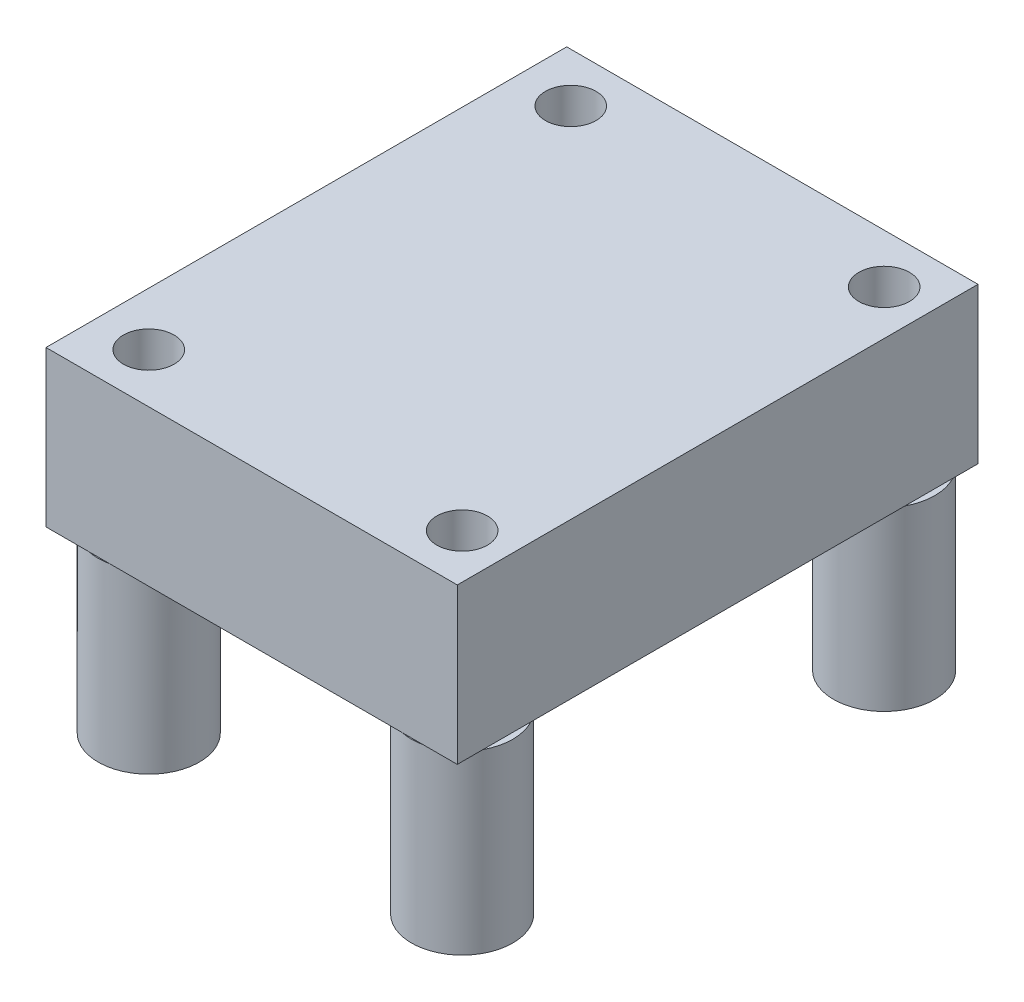
ISO-10303-21;
HEADER;
FILE_DESCRIPTION(('STEP AP214'),'2;1');
FILE_NAME('part.step','',(''),(''),'','','');
FILE_SCHEMA(('AUTOMOTIVE_DESIGN { 1 0 10303 214 1 1 1 1 }'));
ENDSEC;
DATA;
#1=APPLICATION_CONTEXT('core data for automotive mechanical design processes');
#2=APPLICATION_PROTOCOL_DEFINITION('international standard','automotive_design',2000,#1);
#3=PRODUCT_CONTEXT('',#1,'mechanical');
#4=PRODUCT('Part','Part','',(#3));
#5=PRODUCT_RELATED_PRODUCT_CATEGORY('part','',(#4));
#6=PRODUCT_DEFINITION_FORMATION('','',#4);
#7=PRODUCT_DEFINITION_CONTEXT('part definition',#1,'design');
#8=PRODUCT_DEFINITION('design','',#6,#7);
#9=PRODUCT_DEFINITION_SHAPE('','',#8);
#10=(LENGTH_UNIT() NAMED_UNIT(*) SI_UNIT(.MILLI.,.METRE.));
#11=(NAMED_UNIT(*) PLANE_ANGLE_UNIT() SI_UNIT($,.RADIAN.));
#12=(NAMED_UNIT(*) SI_UNIT($,.STERADIAN.) SOLID_ANGLE_UNIT());
#13=UNCERTAINTY_MEASURE_WITH_UNIT(LENGTH_MEASURE(1.E-05),#10,'distance_accuracy_value','');
#14=(GEOMETRIC_REPRESENTATION_CONTEXT(3) GLOBAL_UNCERTAINTY_ASSIGNED_CONTEXT((#13)) GLOBAL_UNIT_ASSIGNED_CONTEXT((#10,
#11,#12)) REPRESENTATION_CONTEXT('',''));
#15=CARTESIAN_POINT('',(0.,0.,0.));
#16=DIRECTION('',(0.,0.,1.));
#17=DIRECTION('',(1.,0.,0.));
#18=AXIS2_PLACEMENT_3D('',#15,#16,#17);
#19=CARTESIAN_POINT('',(0.,0.,0.));
#20=DIRECTION('',(0.,1.,0.));
#21=DIRECTION('',(0.,0.,1.));
#22=AXIS2_PLACEMENT_3D('',#19,#20,#21);
#23=PLANE('',#22);
#24=CARTESIAN_POINT('',(8.92513257327033,0.,-5.63590589990616));
#25=DIRECTION('',(0.,-1.,0.));
#26=DIRECTION('',(0.,0.,-1.));
#27=AXIS2_PLACEMENT_3D('',#24,#25,#26);
#28=CIRCLE('',#27,2.5);
#29=CARTESIAN_POINT('',(9.52448389891559,0.,-8.06299839679359));
#30=VERTEX_POINT('',#29);
#31=CARTESIAN_POINT('',(11.1297811623247,0.,-6.81468687989386));
#32=VERTEX_POINT('',#31);
#33=EDGE_CURVE('E192',#30,#32,#28,.T.);
#34=ORIENTED_EDGE('',*,*,#33,.F.);
#35=DIRECTION('',(-1.,0.,0.));
#36=VECTOR('',#35,1.);
#37=CARTESIAN_POINT('',(-9.17021883767534,0.,-8.06299839679359));
#38=LINE('',#37,#36);
#39=CARTESIAN_POINT('',(11.1297811623247,0.,-8.06299839679359));
#40=VERTEX_POINT('',#39);
#41=EDGE_CURVE('E137',#40,#30,#38,.T.);
#42=ORIENTED_EDGE('',*,*,#41,.F.);
#43=DIRECTION('',(0.,0.,-1.));
#44=VECTOR('',#43,1.);
#45=CARTESIAN_POINT('',(11.1297811623247,0.,-8.06299839679359));
#46=LINE('',#45,#44);
#47=EDGE_CURVE('E240',#32,#40,#46,.T.);
#48=ORIENTED_EDGE('',*,*,#47,.F.);
#49=EDGE_LOOP('',(#34,#42,#48));
#50=FACE_BOUND('',#49,.T.);
#51=ADVANCED_FACE('F37',(#50),#23,.F.);
#52=CARTESIAN_POINT('',(-6.54346742672967,0.,-5.63590589990616));
#53=DIRECTION('',(0.,-1.,0.));
#54=DIRECTION('',(0.,0.,-1.));
#55=AXIS2_PLACEMENT_3D('',#52,#53,#54);
#56=CIRCLE('',#55,2.5);
#57=CARTESIAN_POINT('',(-5.9441161010844,0.,-8.06299839679359));
#58=VERTEX_POINT('',#57);
#59=CARTESIAN_POINT('',(-7.14281875237494,0.,-8.06299839679359));
#60=VERTEX_POINT('',#59);
#61=EDGE_CURVE('E51',#58,#60,#56,.T.);
#62=ORIENTED_EDGE('',*,*,#61,.F.);
#63=CARTESIAN_POINT('',(8.32578124762506,0.,-8.06299839679359));
#64=VERTEX_POINT('',#63);
#65=EDGE_CURVE('E122',#64,#58,#38,.T.);
#66=ORIENTED_EDGE('',*,*,#65,.F.);
#67=CARTESIAN_POINT('',(11.1297811623247,0.,-4.45712491991846));
#68=VERTEX_POINT('',#67);
#69=EDGE_CURVE('E59',#68,#64,#28,.T.);
#70=ORIENTED_EDGE('',*,*,#69,.F.);
#71=CARTESIAN_POINT('',(11.1297811623247,0.,14.0133131201061));
#72=VERTEX_POINT('',#71);
#73=EDGE_CURVE('E243',#72,#68,#46,.T.);
#74=ORIENTED_EDGE('',*,*,#73,.F.);
#75=CARTESIAN_POINT('',(8.92513257327033,0.,15.1920941000938));
#76=DIRECTION('',(0.,1.,0.));
#77=DIRECTION('',(0.,0.,1.));
#78=AXIS2_PLACEMENT_3D('',#75,#76,#77);
#79=CIRCLE('',#78,2.5);
#80=CARTESIAN_POINT('',(8.40318688526834,0.,17.6370016032064));
#81=VERTEX_POINT('',#80);
#82=EDGE_CURVE('E11',#81,#72,#79,.F.);
#83=ORIENTED_EDGE('',*,*,#82,.F.);
#84=DIRECTION('',(1.,0.,0.));
#85=VECTOR('',#84,1.);
#86=CARTESIAN_POINT('',(-9.17021883767534,0.,17.6370016032064));
#87=LINE('',#86,#85);
#88=CARTESIAN_POINT('',(-6.02152173872769,0.,17.6370016032064));
#89=VERTEX_POINT('',#88);
#90=EDGE_CURVE('E244',#89,#81,#87,.T.);
#91=ORIENTED_EDGE('',*,*,#90,.F.);
#92=CARTESIAN_POINT('',(-6.54346742672967,0.,15.1920941000938));
#93=DIRECTION('',(0.,-1.,0.));
#94=DIRECTION('',(0.,0.,-1.));
#95=AXIS2_PLACEMENT_3D('',#92,#93,#94);
#96=CIRCLE('',#95,2.5);
#97=CARTESIAN_POINT('',(-7.06541311473165,0.,17.6370016032064));
#98=VERTEX_POINT('',#97);
#99=EDGE_CURVE('E154',#98,#89,#96,.T.);
#100=ORIENTED_EDGE('',*,*,#99,.F.);
#101=CARTESIAN_POINT('',(-9.17021883767534,0.,17.6370016032064));
#102=VERTEX_POINT('',#101);
#103=EDGE_CURVE('E237',#102,#98,#87,.T.);
#104=ORIENTED_EDGE('',*,*,#103,.F.);
#105=DIRECTION('',(0.,0.,1.));
#106=VECTOR('',#105,1.);
#107=CARTESIAN_POINT('',(-9.17021883767534,0.,-8.06299839679359));
#108=LINE('',#107,#106);
#109=CARTESIAN_POINT('',(-9.17021883767534,0.,-8.06299839679359));
#110=VERTEX_POINT('',#109);
#111=EDGE_CURVE('E171',#110,#102,#108,.T.);
#112=ORIENTED_EDGE('',*,*,#111,.F.);
#113=EDGE_CURVE('E123',#60,#110,#38,.T.);
#114=ORIENTED_EDGE('',*,*,#113,.F.);
#115=EDGE_LOOP('',(#62,#66,#70,#74,#83,#91,#100,#104,#112,#114));
#116=FACE_BOUND('',#115,.T.);
#117=ADVANCED_FACE('F130',(#116),#23,.F.);
#118=CARTESIAN_POINT('',(-9.17021883767534,7.6708,-8.06299839679359));
#119=DIRECTION('',(1.,0.,0.));
#120=DIRECTION('',(0.,0.,-1.));
#121=AXIS2_PLACEMENT_3D('',#118,#119,#120);
#122=PLANE('',#121);
#123=ORIENTED_EDGE('',*,*,#111,.T.);
#124=DIRECTION('',(0.,-1.,0.));
#125=VECTOR('',#124,1.);
#126=CARTESIAN_POINT('',(-9.17021883767534,7.6708,17.6370016032064));
#127=LINE('',#126,#125);
#128=CARTESIAN_POINT('',(-9.17021883767534,7.6708,17.6370016032064));
#129=VERTEX_POINT('',#128);
#130=EDGE_CURVE('E152',#129,#102,#127,.T.);
#131=ORIENTED_EDGE('',*,*,#130,.F.);
#132=DIRECTION('',(0.,0.,1.));
#133=VECTOR('',#132,1.);
#134=CARTESIAN_POINT('',(-9.17021883767534,7.6708,-8.06299839679359));
#135=LINE('',#134,#133);
#136=CARTESIAN_POINT('',(-9.17021883767534,7.6708,-8.06299839679359));
#137=VERTEX_POINT('',#136);
#138=EDGE_CURVE('E140',#137,#129,#135,.T.);
#139=ORIENTED_EDGE('',*,*,#138,.F.);
#140=DIRECTION('',(0.,-1.,0.));
#141=VECTOR('',#140,1.);
#142=CARTESIAN_POINT('',(-9.17021883767534,7.6708,-8.06299839679359));
#143=LINE('',#142,#141);
#144=EDGE_CURVE('E143',#137,#110,#143,.T.);
#145=ORIENTED_EDGE('',*,*,#144,.T.);
#146=EDGE_LOOP('',(#123,#131,#139,#145));
#147=FACE_BOUND('',#146,.T.);
#148=ADVANCED_FACE('F39',(#147),#122,.F.);
#149=CARTESIAN_POINT('',(-9.17021883767534,7.6708,17.6370016032064));
#150=DIRECTION('',(0.,0.,-1.));
#151=DIRECTION('',(-1.,0.,0.));
#152=AXIS2_PLACEMENT_3D('',#149,#150,#151);
#153=PLANE('',#152);
#154=ORIENTED_EDGE('',*,*,#103,.T.);
#155=EDGE_CURVE('E241',#98,#89,#87,.T.);
#156=ORIENTED_EDGE('',*,*,#155,.T.);
#157=ORIENTED_EDGE('',*,*,#90,.T.);
#158=CARTESIAN_POINT('',(9.44707826127232,0.,17.6370016032064));
#159=VERTEX_POINT('',#158);
#160=EDGE_CURVE('E236',#81,#159,#87,.T.);
#161=ORIENTED_EDGE('',*,*,#160,.T.);
#162=CARTESIAN_POINT('',(11.1297811623247,0.,17.6370016032064));
#163=VERTEX_POINT('',#162);
#164=EDGE_CURVE('E234',#159,#163,#87,.T.);
#165=ORIENTED_EDGE('',*,*,#164,.T.);
#166=DIRECTION('',(0.,-1.,0.));
#167=VECTOR('',#166,1.);
#168=CARTESIAN_POINT('',(11.1297811623247,7.6708,17.6370016032064));
#169=LINE('',#168,#167);
#170=CARTESIAN_POINT('',(11.1297811623247,7.6708,17.6370016032064));
#171=VERTEX_POINT('',#170);
#172=EDGE_CURVE('E150',#171,#163,#169,.T.);
#173=ORIENTED_EDGE('',*,*,#172,.F.);
#174=DIRECTION('',(1.,0.,0.));
#175=VECTOR('',#174,1.);
#176=CARTESIAN_POINT('',(-9.17021883767534,7.6708,17.6370016032064));
#177=LINE('',#176,#175);
#178=EDGE_CURVE('E229',#129,#171,#177,.T.);
#179=ORIENTED_EDGE('',*,*,#178,.F.);
#180=ORIENTED_EDGE('',*,*,#130,.T.);
#181=EDGE_LOOP('',(#154,#156,#157,#161,#165,#173,#179,#180));
#182=FACE_BOUND('',#181,.T.);
#183=ADVANCED_FACE('F249',(#182),#153,.F.);
#184=CARTESIAN_POINT('',(11.1297811623247,7.6708,-8.06299839679359));
#185=DIRECTION('',(-1.,0.,0.));
#186=DIRECTION('',(0.,0.,1.));
#187=AXIS2_PLACEMENT_3D('',#184,#185,#186);
#188=PLANE('',#187);
#189=CARTESIAN_POINT('',(11.1297811623247,0.,16.3708750800815));
#190=VERTEX_POINT('',#189);
#191=EDGE_CURVE('E141',#163,#190,#46,.T.);
#192=ORIENTED_EDGE('',*,*,#191,.T.);
#193=EDGE_CURVE('E264',#190,#72,#46,.T.);
#194=ORIENTED_EDGE('',*,*,#193,.T.);
#195=ORIENTED_EDGE('',*,*,#73,.T.);
#196=DIRECTION('',(0.,0.,1.));
#197=VECTOR('',#196,1.);
#198=CARTESIAN_POINT('',(11.1297811623247,0.,-8.06299839679359));
#199=LINE('',#198,#197);
#200=EDGE_CURVE('E185',#32,#68,#199,.T.);
#201=ORIENTED_EDGE('',*,*,#200,.F.);
#202=ORIENTED_EDGE('',*,*,#47,.T.);
#203=DIRECTION('',(0.,-1.,0.));
#204=VECTOR('',#203,1.);
#205=CARTESIAN_POINT('',(11.1297811623247,7.6708,-8.06299839679359));
#206=LINE('',#205,#204);
#207=CARTESIAN_POINT('',(11.1297811623247,7.6708,-8.06299839679359));
#208=VERTEX_POINT('',#207);
#209=EDGE_CURVE('E146',#208,#40,#206,.T.);
#210=ORIENTED_EDGE('',*,*,#209,.F.);
#211=DIRECTION('',(0.,0.,-1.));
#212=VECTOR('',#211,1.);
#213=CARTESIAN_POINT('',(11.1297811623247,7.6708,-8.06299839679359));
#214=LINE('',#213,#212);
#215=EDGE_CURVE('E277',#171,#208,#214,.T.);
#216=ORIENTED_EDGE('',*,*,#215,.F.);
#217=ORIENTED_EDGE('',*,*,#172,.T.);
#218=EDGE_LOOP('',(#192,#194,#195,#201,#202,#210,#216,#217));
#219=FACE_BOUND('',#218,.T.);
#220=ADVANCED_FACE('F268',(#219),#188,.F.);
#221=CARTESIAN_POINT('',(-9.17021883767534,7.6708,-8.06299839679359));
#222=DIRECTION('',(0.,0.,1.));
#223=DIRECTION('',(1.,0.,0.));
#224=AXIS2_PLACEMENT_3D('',#221,#222,#223);
#225=PLANE('',#224);
#226=ORIENTED_EDGE('',*,*,#41,.T.);
#227=EDGE_CURVE('E136',#30,#64,#38,.T.);
#228=ORIENTED_EDGE('',*,*,#227,.T.);
#229=ORIENTED_EDGE('',*,*,#65,.T.);
#230=EDGE_CURVE('E116',#58,#60,#38,.T.);
#231=ORIENTED_EDGE('',*,*,#230,.T.);
#232=ORIENTED_EDGE('',*,*,#113,.T.);
#233=ORIENTED_EDGE('',*,*,#144,.F.);
#234=DIRECTION('',(-1.,0.,0.));
#235=VECTOR('',#234,1.);
#236=CARTESIAN_POINT('',(-9.17021883767534,7.6708,-8.06299839679359));
#237=LINE('',#236,#235);
#238=EDGE_CURVE('E147',#208,#137,#237,.T.);
#239=ORIENTED_EDGE('',*,*,#238,.F.);
#240=ORIENTED_EDGE('',*,*,#209,.T.);
#241=EDGE_LOOP('',(#226,#228,#229,#231,#232,#233,#239,#240));
#242=FACE_BOUND('',#241,.T.);
#243=ADVANCED_FACE('F135',(#242),#225,.F.);
#244=CARTESIAN_POINT('',(0.,7.6708,0.));
#245=DIRECTION('',(0.,1.,0.));
#246=DIRECTION('',(0.,0.,1.));
#247=AXIS2_PLACEMENT_3D('',#244,#245,#246);
#248=PLANE('',#247);
#249=CARTESIAN_POINT('',(-6.54346742672967,7.6708,-5.63590589990616));
#250=DIRECTION('',(0.,1.,0.));
#251=DIRECTION('',(0.,0.,1.));
#252=AXIS2_PLACEMENT_3D('',#249,#250,#251);
#253=CIRCLE('',#252,1.25);
#254=CARTESIAN_POINT('',(-6.54346742672967,7.6708,-4.38590589990616));
#255=VERTEX_POINT('',#254);
#256=EDGE_CURVE('E207',#255,#255,#253,.T.);
#257=ORIENTED_EDGE('',*,*,#256,.F.);
#258=EDGE_LOOP('',(#257));
#259=FACE_BOUND('',#258,.T.);
#260=CARTESIAN_POINT('',(8.92513257327033,7.6708,15.1920941000938));
#261=DIRECTION('',(0.,1.,0.));
#262=DIRECTION('',(0.,0.,1.));
#263=AXIS2_PLACEMENT_3D('',#260,#261,#262);
#264=CIRCLE('',#263,1.25);
#265=CARTESIAN_POINT('',(8.92513257327033,7.6708,16.4420941000938));
#266=VERTEX_POINT('',#265);
#267=EDGE_CURVE('E208',#266,#266,#264,.T.);
#268=ORIENTED_EDGE('',*,*,#267,.F.);
#269=EDGE_LOOP('',(#268));
#270=FACE_BOUND('',#269,.T.);
#271=CARTESIAN_POINT('',(-6.54346742672967,7.6708,15.1920941000938));
#272=DIRECTION('',(0.,1.,0.));
#273=DIRECTION('',(0.,0.,1.));
#274=AXIS2_PLACEMENT_3D('',#271,#272,#273);
#275=CIRCLE('',#274,1.25);
#276=CARTESIAN_POINT('',(-6.54346742672967,7.6708,16.4420941000938));
#277=VERTEX_POINT('',#276);
#278=EDGE_CURVE('E211',#277,#277,#275,.T.);
#279=ORIENTED_EDGE('',*,*,#278,.F.);
#280=EDGE_LOOP('',(#279));
#281=FACE_BOUND('',#280,.T.);
#282=CARTESIAN_POINT('',(8.92513257327033,7.6708,-5.63590589990616));
#283=DIRECTION('',(0.,1.,0.));
#284=DIRECTION('',(0.,0.,1.));
#285=AXIS2_PLACEMENT_3D('',#282,#283,#284);
#286=CIRCLE('',#285,1.25);
#287=CARTESIAN_POINT('',(8.92513257327033,7.6708,-4.38590589990616));
#288=VERTEX_POINT('',#287);
#289=EDGE_CURVE('E203',#288,#288,#286,.T.);
#290=ORIENTED_EDGE('',*,*,#289,.F.);
#291=EDGE_LOOP('',(#290));
#292=FACE_BOUND('',#291,.T.);
#293=ORIENTED_EDGE('',*,*,#138,.T.);
#294=ORIENTED_EDGE('',*,*,#178,.T.);
#295=ORIENTED_EDGE('',*,*,#215,.T.);
#296=ORIENTED_EDGE('',*,*,#238,.T.);
#297=EDGE_LOOP('',(#293,#294,#295,#296));
#298=FACE_BOUND('',#297,.T.);
#299=ADVANCED_FACE('F219',(#259,#270,#281,#292,#298),#248,.T.);
#300=EDGE_CURVE('E41',#190,#159,#79,.F.);
#301=ORIENTED_EDGE('',*,*,#300,.F.);
#302=ORIENTED_EDGE('',*,*,#191,.F.);
#303=ORIENTED_EDGE('',*,*,#164,.F.);
#304=EDGE_LOOP('',(#301,#302,#303));
#305=FACE_BOUND('',#304,.T.);
#306=ADVANCED_FACE('F222',(#305),#23,.F.);
#307=CARTESIAN_POINT('',(-6.54346742672967,-8.7122,15.1920941000938));
#308=DIRECTION('',(0.,-1.,0.));
#309=DIRECTION('',(0.,0.,-1.));
#310=AXIS2_PLACEMENT_3D('',#307,#308,#309);
#311=PLANE('',#310);
#312=CARTESIAN_POINT('',(-6.54346742672967,-8.7122,15.1920941000938));
#313=DIRECTION('',(0.,-1.,0.));
#314=DIRECTION('',(0.,0.,-1.));
#315=AXIS2_PLACEMENT_3D('',#312,#313,#314);
#316=CIRCLE('',#315,2.5);
#317=CARTESIAN_POINT('',(-6.54346742672967,-8.7122,12.6920941000938));
#318=VERTEX_POINT('',#317);
#319=EDGE_CURVE('E168',#318,#318,#316,.T.);
#320=ORIENTED_EDGE('',*,*,#319,.T.);
#321=EDGE_LOOP('',(#320));
#322=FACE_BOUND('',#321,.T.);
#323=CARTESIAN_POINT('',(-6.54346742672967,-8.7122,15.1920941000938));
#324=DIRECTION('',(0.,-1.,0.));
#325=DIRECTION('',(0.,0.,-1.));
#326=AXIS2_PLACEMENT_3D('',#323,#324,#325);
#327=CIRCLE('',#326,1.25);
#328=CARTESIAN_POINT('',(-6.54346742672967,-8.7122,13.9420941000938));
#329=VERTEX_POINT('',#328);
#330=EDGE_CURVE('E169',#329,#329,#327,.T.);
#331=ORIENTED_EDGE('',*,*,#330,.F.);
#332=EDGE_LOOP('',(#331));
#333=FACE_BOUND('',#332,.T.);
#334=ADVANCED_FACE('F286',(#322,#333),#311,.T.);
#335=CARTESIAN_POINT('',(-6.54346742672967,0.,15.1920941000938));
#336=DIRECTION('',(0.,-1.,0.));
#337=DIRECTION('',(0.,0.,-1.));
#338=AXIS2_PLACEMENT_3D('',#335,#336,#337);
#339=PLANE('',#338);
#340=ORIENTED_EDGE('',*,*,#155,.F.);
#341=EDGE_CURVE('E161',#89,#98,#96,.T.);
#342=ORIENTED_EDGE('',*,*,#341,.F.);
#343=EDGE_LOOP('',(#340,#342));
#344=FACE_BOUND('',#343,.T.);
#345=ADVANCED_FACE('F290',(#344),#339,.F.);
#346=CARTESIAN_POINT('',(-6.54346742672967,-8.7122,15.1920941000938));
#347=DIRECTION('',(0.,1.,0.));
#348=DIRECTION('',(0.,0.,1.));
#349=AXIS2_PLACEMENT_3D('',#346,#347,#348);
#350=CYLINDRICAL_SURFACE('',#349,2.5);
#351=ORIENTED_EDGE('',*,*,#319,.F.);
#352=EDGE_LOOP('',(#351));
#353=FACE_BOUND('',#352,.T.);
#354=ORIENTED_EDGE('',*,*,#341,.T.);
#355=ORIENTED_EDGE('',*,*,#99,.T.);
#356=EDGE_LOOP('',(#354,#355));
#357=FACE_BOUND('',#356,.T.);
#358=ADVANCED_FACE('F296',(#353,#357),#350,.T.);
#359=CARTESIAN_POINT('',(-6.54346742672967,-8.7122,15.1920941000938));
#360=DIRECTION('',(0.,1.,0.));
#361=DIRECTION('',(0.,0.,1.));
#362=AXIS2_PLACEMENT_3D('',#359,#360,#361);
#363=CYLINDRICAL_SURFACE('',#362,1.25);
#364=ORIENTED_EDGE('',*,*,#330,.T.);
#365=EDGE_LOOP('',(#364));
#366=FACE_BOUND('',#365,.T.);
#367=ORIENTED_EDGE('',*,*,#278,.T.);
#368=EDGE_LOOP('',(#367));
#369=FACE_BOUND('',#368,.T.);
#370=ADVANCED_FACE('F217',(#366,#369),#363,.F.);
#371=CARTESIAN_POINT('',(8.92513257327033,0.,15.1920941000938));
#372=DIRECTION('',(0.,-1.,0.));
#373=DIRECTION('',(0.,0.,-1.));
#374=AXIS2_PLACEMENT_3D('',#371,#372,#373);
#375=PLANE('',#374);
#376=CARTESIAN_POINT('',(8.92513257327033,0.,15.1920941000938));
#377=DIRECTION('',(0.,-1.,0.));
#378=DIRECTION('',(0.,0.,-1.));
#379=AXIS2_PLACEMENT_3D('',#376,#377,#378);
#380=CIRCLE('',#379,2.5);
#381=EDGE_CURVE('E184',#159,#81,#380,.T.);
#382=ORIENTED_EDGE('',*,*,#381,.F.);
#383=ORIENTED_EDGE('',*,*,#160,.F.);
#384=EDGE_LOOP('',(#382,#383));
#385=FACE_BOUND('',#384,.T.);
#386=ADVANCED_FACE('F256',(#385),#375,.F.);
#387=EDGE_CURVE('E178',#72,#190,#380,.T.);
#388=ORIENTED_EDGE('',*,*,#387,.F.);
#389=ORIENTED_EDGE('',*,*,#193,.F.);
#390=EDGE_LOOP('',(#388,#389));
#391=FACE_BOUND('',#390,.T.);
#392=ADVANCED_FACE('F262',(#391),#375,.F.);
#393=CARTESIAN_POINT('',(8.92513257327033,-8.7122,15.1920941000938));
#394=DIRECTION('',(0.,-1.,0.));
#395=DIRECTION('',(0.,0.,-1.));
#396=AXIS2_PLACEMENT_3D('',#393,#394,#395);
#397=PLANE('',#396);
#398=CARTESIAN_POINT('',(8.92513257327033,-8.7122,15.1920941000938));
#399=DIRECTION('',(0.,-1.,0.));
#400=DIRECTION('',(0.,0.,-1.));
#401=AXIS2_PLACEMENT_3D('',#398,#399,#400);
#402=CIRCLE('',#401,2.5);
#403=CARTESIAN_POINT('',(8.92513257327033,-8.7122,12.6920941000938));
#404=VERTEX_POINT('',#403);
#405=EDGE_CURVE('E181',#404,#404,#402,.T.);
#406=ORIENTED_EDGE('',*,*,#405,.T.);
#407=EDGE_LOOP('',(#406));
#408=FACE_BOUND('',#407,.T.);
#409=CARTESIAN_POINT('',(8.92513257327033,-8.7122,15.1920941000938));
#410=DIRECTION('',(0.,-1.,0.));
#411=DIRECTION('',(0.,0.,-1.));
#412=AXIS2_PLACEMENT_3D('',#409,#410,#411);
#413=CIRCLE('',#412,1.25);
#414=CARTESIAN_POINT('',(8.92513257327033,-8.7122,13.9420941000938));
#415=VERTEX_POINT('',#414);
#416=EDGE_CURVE('E173',#415,#415,#413,.T.);
#417=ORIENTED_EDGE('',*,*,#416,.F.);
#418=EDGE_LOOP('',(#417));
#419=FACE_BOUND('',#418,.T.);
#420=ADVANCED_FACE('F316',(#408,#419),#397,.T.);
#421=CARTESIAN_POINT('',(8.92513257327033,-8.7122,15.1920941000938));
#422=DIRECTION('',(0.,1.,0.));
#423=DIRECTION('',(0.,0.,1.));
#424=AXIS2_PLACEMENT_3D('',#421,#422,#423);
#425=CYLINDRICAL_SURFACE('',#424,2.5);
#426=ORIENTED_EDGE('',*,*,#405,.F.);
#427=EDGE_LOOP('',(#426));
#428=FACE_BOUND('',#427,.T.);
#429=ORIENTED_EDGE('',*,*,#387,.T.);
#430=ORIENTED_EDGE('',*,*,#300,.T.);
#431=ORIENTED_EDGE('',*,*,#381,.T.);
#432=ORIENTED_EDGE('',*,*,#82,.T.);
#433=EDGE_LOOP('',(#429,#430,#431,#432));
#434=FACE_BOUND('',#433,.T.);
#435=ADVANCED_FACE('F258',(#428,#434),#425,.T.);
#436=CARTESIAN_POINT('',(8.92513257327033,-8.7122,15.1920941000938));
#437=DIRECTION('',(0.,1.,0.));
#438=DIRECTION('',(0.,0.,1.));
#439=AXIS2_PLACEMENT_3D('',#436,#437,#438);
#440=CYLINDRICAL_SURFACE('',#439,1.25);
#441=ORIENTED_EDGE('',*,*,#416,.T.);
#442=EDGE_LOOP('',(#441));
#443=FACE_BOUND('',#442,.T.);
#444=ORIENTED_EDGE('',*,*,#267,.T.);
#445=EDGE_LOOP('',(#444));
#446=FACE_BOUND('',#445,.T.);
#447=ADVANCED_FACE('F322',(#443,#446),#440,.F.);
#448=CARTESIAN_POINT('',(8.92513257327033,0.,-5.63590589990616));
#449=DIRECTION('',(0.,-1.,0.));
#450=DIRECTION('',(0.,0.,-1.));
#451=AXIS2_PLACEMENT_3D('',#448,#449,#450);
#452=PLANE('',#451);
#453=EDGE_CURVE('E199',#32,#68,#28,.T.);
#454=ORIENTED_EDGE('',*,*,#453,.F.);
#455=ORIENTED_EDGE('',*,*,#200,.T.);
#456=EDGE_LOOP('',(#454,#455));
#457=FACE_BOUND('',#456,.T.);
#458=ADVANCED_FACE('F324',(#457),#452,.F.);
#459=EDGE_CURVE('E196',#64,#30,#28,.T.);
#460=ORIENTED_EDGE('',*,*,#459,.F.);
#461=ORIENTED_EDGE('',*,*,#227,.F.);
#462=EDGE_LOOP('',(#460,#461));
#463=FACE_BOUND('',#462,.T.);
#464=ADVANCED_FACE('F330',(#463),#452,.F.);
#465=CARTESIAN_POINT('',(8.92513257327033,-8.7122,-5.63590589990616));
#466=DIRECTION('',(0.,-1.,0.));
#467=DIRECTION('',(0.,0.,-1.));
#468=AXIS2_PLACEMENT_3D('',#465,#466,#467);
#469=PLANE('',#468);
#470=CARTESIAN_POINT('',(8.92513257327033,-8.7122,-5.63590589990616));
#471=DIRECTION('',(0.,-1.,0.));
#472=DIRECTION('',(0.,0.,-1.));
#473=AXIS2_PLACEMENT_3D('',#470,#471,#472);
#474=CIRCLE('',#473,2.5);
#475=CARTESIAN_POINT('',(8.92513257327033,-8.7122,-8.13590589990616));
#476=VERTEX_POINT('',#475);
#477=EDGE_CURVE('E193',#476,#476,#474,.T.);
#478=ORIENTED_EDGE('',*,*,#477,.T.);
#479=EDGE_LOOP('',(#478));
#480=FACE_BOUND('',#479,.T.);
#481=CARTESIAN_POINT('',(8.92513257327033,-8.7122,-5.63590589990616));
#482=DIRECTION('',(0.,-1.,0.));
#483=DIRECTION('',(0.,0.,-1.));
#484=AXIS2_PLACEMENT_3D('',#481,#482,#483);
#485=CIRCLE('',#484,1.25);
#486=CARTESIAN_POINT('',(8.92513257327033,-8.7122,-6.88590589990616));
#487=VERTEX_POINT('',#486);
#488=EDGE_CURVE('E189',#487,#487,#485,.T.);
#489=ORIENTED_EDGE('',*,*,#488,.F.);
#490=EDGE_LOOP('',(#489));
#491=FACE_BOUND('',#490,.T.);
#492=ADVANCED_FACE('F500',(#480,#491),#469,.T.);
#493=CARTESIAN_POINT('',(8.92513257327033,-8.7122,-5.63590589990616));
#494=DIRECTION('',(0.,1.,0.));
#495=DIRECTION('',(0.,0.,1.));
#496=AXIS2_PLACEMENT_3D('',#493,#494,#495);
#497=CYLINDRICAL_SURFACE('',#496,2.5);
#498=ORIENTED_EDGE('',*,*,#477,.F.);
#499=EDGE_LOOP('',(#498));
#500=FACE_BOUND('',#499,.T.);
#501=ORIENTED_EDGE('',*,*,#33,.T.);
#502=ORIENTED_EDGE('',*,*,#453,.T.);
#503=ORIENTED_EDGE('',*,*,#69,.T.);
#504=ORIENTED_EDGE('',*,*,#459,.T.);
#505=EDGE_LOOP('',(#501,#502,#503,#504));
#506=FACE_BOUND('',#505,.T.);
#507=ADVANCED_FACE('F270',(#500,#506),#497,.T.);
#508=CARTESIAN_POINT('',(8.92513257327033,-8.7122,-5.63590589990616));
#509=DIRECTION('',(0.,1.,0.));
#510=DIRECTION('',(0.,0.,1.));
#511=AXIS2_PLACEMENT_3D('',#508,#509,#510);
#512=CYLINDRICAL_SURFACE('',#511,1.25);
#513=ORIENTED_EDGE('',*,*,#488,.T.);
#514=EDGE_LOOP('',(#513));
#515=FACE_BOUND('',#514,.T.);
#516=ORIENTED_EDGE('',*,*,#289,.T.);
#517=EDGE_LOOP('',(#516));
#518=FACE_BOUND('',#517,.T.);
#519=ADVANCED_FACE('F458',(#515,#518),#512,.F.);
#520=CARTESIAN_POINT('',(-6.54346742672967,0.,-5.63590589990616));
#521=DIRECTION('',(0.,-1.,0.));
#522=DIRECTION('',(0.,0.,-1.));
#523=AXIS2_PLACEMENT_3D('',#520,#521,#522);
#524=PLANE('',#523);
#525=EDGE_CURVE('E118',#60,#58,#56,.T.);
#526=ORIENTED_EDGE('',*,*,#525,.F.);
#527=ORIENTED_EDGE('',*,*,#230,.F.);
#528=EDGE_LOOP('',(#526,#527));
#529=FACE_BOUND('',#528,.T.);
#530=ADVANCED_FACE('F117',(#529),#524,.F.);
#531=CARTESIAN_POINT('',(-6.54346742672967,-8.7122,-5.63590589990616));
#532=DIRECTION('',(0.,-1.,0.));
#533=DIRECTION('',(0.,0.,-1.));
#534=AXIS2_PLACEMENT_3D('',#531,#532,#533);
#535=PLANE('',#534);
#536=CARTESIAN_POINT('',(-6.54346742672967,-8.7122,-5.63590589990616));
#537=DIRECTION('',(0.,-1.,0.));
#538=DIRECTION('',(0.,0.,-1.));
#539=AXIS2_PLACEMENT_3D('',#536,#537,#538);
#540=CIRCLE('',#539,2.5);
#541=CARTESIAN_POINT('',(-6.54346742672967,-8.7122,-8.13590589990616));
#542=VERTEX_POINT('',#541);
#543=EDGE_CURVE('E126',#542,#542,#540,.T.);
#544=ORIENTED_EDGE('',*,*,#543,.T.);
#545=EDGE_LOOP('',(#544));
#546=FACE_BOUND('',#545,.T.);
#547=CARTESIAN_POINT('',(-6.54346742672967,-8.7122,-5.63590589990616));
#548=DIRECTION('',(0.,-1.,0.));
#549=DIRECTION('',(0.,0.,-1.));
#550=AXIS2_PLACEMENT_3D('',#547,#548,#549);
#551=CIRCLE('',#550,1.25);
#552=CARTESIAN_POINT('',(-6.54346742672967,-8.7122,-6.88590589990616));
#553=VERTEX_POINT('',#552);
#554=EDGE_CURVE('E133',#553,#553,#551,.T.);
#555=ORIENTED_EDGE('',*,*,#554,.F.);
#556=EDGE_LOOP('',(#555));
#557=FACE_BOUND('',#556,.T.);
#558=ADVANCED_FACE('F480',(#546,#557),#535,.T.);
#559=CARTESIAN_POINT('',(-6.54346742672967,-8.7122,-5.63590589990616));
#560=DIRECTION('',(0.,1.,0.));
#561=DIRECTION('',(0.,0.,1.));
#562=AXIS2_PLACEMENT_3D('',#559,#560,#561);
#563=CYLINDRICAL_SURFACE('',#562,2.5);
#564=ORIENTED_EDGE('',*,*,#543,.F.);
#565=EDGE_LOOP('',(#564));
#566=FACE_BOUND('',#565,.T.);
#567=ORIENTED_EDGE('',*,*,#61,.T.);
#568=ORIENTED_EDGE('',*,*,#525,.T.);
#569=EDGE_LOOP('',(#567,#568));
#570=FACE_BOUND('',#569,.T.);
#571=ADVANCED_FACE('F125',(#566,#570),#563,.T.);
#572=CARTESIAN_POINT('',(-6.54346742672967,-8.7122,-5.63590589990616));
#573=DIRECTION('',(0.,1.,0.));
#574=DIRECTION('',(0.,0.,1.));
#575=AXIS2_PLACEMENT_3D('',#572,#573,#574);
#576=CYLINDRICAL_SURFACE('',#575,1.25);
#577=ORIENTED_EDGE('',*,*,#554,.T.);
#578=EDGE_LOOP('',(#577));
#579=FACE_BOUND('',#578,.T.);
#580=ORIENTED_EDGE('',*,*,#256,.T.);
#581=EDGE_LOOP('',(#580));
#582=FACE_BOUND('',#581,.T.);
#583=ADVANCED_FACE('F470',(#579,#582),#576,.F.);
#584=CLOSED_SHELL('',(#51,#117,#148,#183,#220,#243,#299,#306,#334,#345,#358,#370,#386,#392,#420,
#435,#447,#458,#464,#492,#507,#519,#530,#558,#571,#583));
#585=MANIFOLD_SOLID_BREP('B2',#584);
#586=ADVANCED_BREP_SHAPE_REPRESENTATION('',(#18,#585),#14);
#587=SHAPE_DEFINITION_REPRESENTATION(#9,#586);
ENDSEC;
END-ISO-10303-21;
